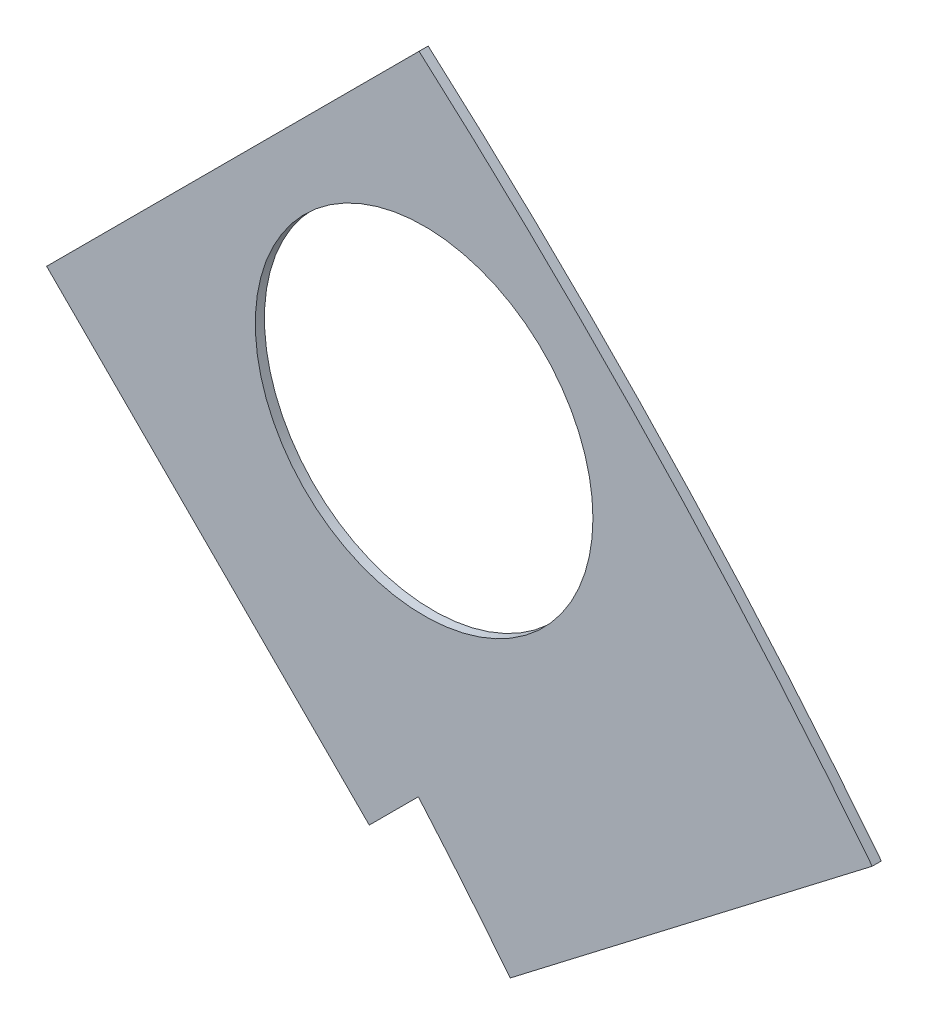
ISO-10303-21;
HEADER;
FILE_DESCRIPTION(('STEP AP214'),'2;1');
FILE_NAME('part.step','',(''),(''),'','','');
FILE_SCHEMA(('AUTOMOTIVE_DESIGN { 1 0 10303 214 1 1 1 1 }'));
ENDSEC;
DATA;
#1=APPLICATION_CONTEXT('core data for automotive mechanical design processes');
#2=APPLICATION_PROTOCOL_DEFINITION('international standard','automotive_design',2000,#1);
#3=PRODUCT_CONTEXT('',#1,'mechanical');
#4=PRODUCT('Part','Part','',(#3));
#5=PRODUCT_RELATED_PRODUCT_CATEGORY('part','',(#4));
#6=PRODUCT_DEFINITION_FORMATION('','',#4);
#7=PRODUCT_DEFINITION_CONTEXT('part definition',#1,'design');
#8=PRODUCT_DEFINITION('design','',#6,#7);
#9=PRODUCT_DEFINITION_SHAPE('','',#8);
#10=(LENGTH_UNIT() NAMED_UNIT(*) SI_UNIT(.MILLI.,.METRE.));
#11=(NAMED_UNIT(*) PLANE_ANGLE_UNIT() SI_UNIT($,.RADIAN.));
#12=(NAMED_UNIT(*) SI_UNIT($,.STERADIAN.) SOLID_ANGLE_UNIT());
#13=UNCERTAINTY_MEASURE_WITH_UNIT(LENGTH_MEASURE(1.E-05),#10,'distance_accuracy_value','');
#14=(GEOMETRIC_REPRESENTATION_CONTEXT(3) GLOBAL_UNCERTAINTY_ASSIGNED_CONTEXT((#13)) GLOBAL_UNIT_ASSIGNED_CONTEXT((#10,
#11,#12)) REPRESENTATION_CONTEXT('',''));
#15=CARTESIAN_POINT('',(0.,0.,0.));
#16=DIRECTION('',(0.,0.,1.));
#17=DIRECTION('',(1.,0.,0.));
#18=AXIS2_PLACEMENT_3D('',#15,#16,#17);
#19=CARTESIAN_POINT('',(0.,0.,0.254));
#20=DIRECTION('',(0.,0.,-1.));
#21=DIRECTION('',(-1.,0.,0.));
#22=AXIS2_PLACEMENT_3D('',#19,#20,#21);
#23=PLANE('',#22);
#24=CARTESIAN_POINT('',(67.3519209080185,67.3519209080188,0.254));
#25=DIRECTION('',(0.,0.,1.));
#26=DIRECTION('',(1.,0.,0.));
#27=AXIS2_PLACEMENT_3D('',#24,#25,#26);
#28=CIRCLE('',#27,4.69899999999999);
#29=CARTESIAN_POINT('',(72.0509209080185,67.3519209080188,0.254));
#30=VERTEX_POINT('',#29);
#31=EDGE_CURVE('E111',#30,#30,#28,.T.);
#32=ORIENTED_EDGE('',*,*,#31,.F.);
#33=EDGE_LOOP('',(#32));
#34=FACE_BOUND('',#33,.T.);
#35=CARTESIAN_POINT('',(0.,0.,0.254));
#36=DIRECTION('',(0.,0.,1.));
#37=DIRECTION('',(-1.,0.,0.));
#38=AXIS2_PLACEMENT_3D('',#35,#36,#37);
#39=CIRCLE('',#38,88.9);
#40=CARTESIAN_POINT('',(69.7487877216676,55.1209271634445,0.254));
#41=VERTEX_POINT('',#40);
#42=CARTESIAN_POINT('',(67.191354125102,58.2110980040331,0.254));
#43=VERTEX_POINT('',#42);
#44=EDGE_CURVE('E50',#41,#43,#39,.T.);
#45=ORIENTED_EDGE('',*,*,#44,.F.);
#46=DIRECTION('',(-0.79335334029125,-0.608761429008702,0.));
#47=VECTOR('',#46,1.);
#48=CARTESIAN_POINT('',(79.3277929876634,62.4711564220355,0.254));
#49=LINE('',#48,#47);
#50=CARTESIAN_POINT('',(79.8252748706045,62.8528876968468,0.254));
#51=VERTEX_POINT('',#50);
#52=EDGE_CURVE('E90',#51,#41,#49,.T.);
#53=ORIENTED_EDGE('',*,*,#52,.F.);
#54=CARTESIAN_POINT('',(0.,0.,0.254));
#55=DIRECTION('',(0.,0.,1.));
#56=DIRECTION('',(-1.,0.,0.));
#57=AXIS2_PLACEMENT_3D('',#54,#55,#56);
#58=CIRCLE('',#57,101.6);
#59=CARTESIAN_POINT('',(67.2114671100052,76.1917232310746,0.254));
#60=VERTEX_POINT('',#59);
#61=EDGE_CURVE('E59',#51,#60,#58,.T.);
#62=ORIENTED_EDGE('',*,*,#61,.T.);
#63=DIRECTION('',(-0.707106781186546,-0.707106781186549,0.));
#64=VECTOR('',#63,1.);
#65=CARTESIAN_POINT('',(67.2114671100052,76.1917232310746,0.254));
#66=LINE('',#65,#64);
#67=CARTESIAN_POINT('',(56.8450212463676,65.825277367437,0.254));
#68=VERTEX_POINT('',#67);
#69=EDGE_CURVE('E119',#60,#68,#66,.T.);
#70=ORIENTED_EDGE('',*,*,#69,.T.);
#71=DIRECTION('',(-0.707106781186548,0.707106781186548,0.));
#72=VECTOR('',#71,1.);
#73=CARTESIAN_POINT('',(56.8450212463676,65.825277367437,0.254));
#74=LINE('',#73,#72);
#75=CARTESIAN_POINT('',(65.8252773674368,56.8450212463678,0.254));
#76=VERTEX_POINT('',#75);
#77=EDGE_CURVE('E141',#76,#68,#74,.T.);
#78=ORIENTED_EDGE('',*,*,#77,.F.);
#79=DIRECTION('',(-0.707106781186546,-0.707106781186549,0.));
#80=VECTOR('',#79,1.);
#81=CARTESIAN_POINT('',(67.191354125102,58.2110980040331,0.254));
#82=LINE('',#81,#80);
#83=EDGE_CURVE('E103',#43,#76,#82,.T.);
#84=ORIENTED_EDGE('',*,*,#83,.F.);
#85=EDGE_LOOP('',(#45,#53,#62,#70,#78,#84));
#86=FACE_BOUND('',#85,.T.);
#87=ADVANCED_FACE('F35',(#34,#86),#23,.F.);
#88=CARTESIAN_POINT('',(0.,0.,0.));
#89=DIRECTION('',(0.,0.,-1.));
#90=DIRECTION('',(-1.,0.,0.));
#91=AXIS2_PLACEMENT_3D('',#88,#89,#90);
#92=PLANE('',#91);
#93=CARTESIAN_POINT('',(67.3519209080185,67.3519209080188,0.));
#94=DIRECTION('',(0.,0.,1.));
#95=DIRECTION('',(1.,0.,0.));
#96=AXIS2_PLACEMENT_3D('',#93,#94,#95);
#97=CIRCLE('',#96,4.69899999999999);
#98=CARTESIAN_POINT('',(72.0509209080185,67.3519209080188,0.));
#99=VERTEX_POINT('',#98);
#100=EDGE_CURVE('E114',#99,#99,#97,.T.);
#101=ORIENTED_EDGE('',*,*,#100,.T.);
#102=EDGE_LOOP('',(#101));
#103=FACE_BOUND('',#102,.T.);
#104=DIRECTION('',(0.79335334029125,0.608761429008702,0.));
#105=VECTOR('',#104,1.);
#106=CARTESIAN_POINT('',(-0.773127014842661,1.00755874217198,0.));
#107=LINE('',#106,#105);
#108=CARTESIAN_POINT('',(69.7487877216676,55.1209271634445,0.));
#109=VERTEX_POINT('',#108);
#110=CARTESIAN_POINT('',(79.8252748706045,62.8528876968468,0.));
#111=VERTEX_POINT('',#110);
#112=EDGE_CURVE('E12',#109,#111,#107,.T.);
#113=ORIENTED_EDGE('',*,*,#112,.F.);
#114=CARTESIAN_POINT('',(0.,0.,0.));
#115=DIRECTION('',(0.,0.,1.));
#116=DIRECTION('',(-1.,0.,0.));
#117=AXIS2_PLACEMENT_3D('',#114,#115,#116);
#118=CIRCLE('',#117,88.9);
#119=CARTESIAN_POINT('',(67.191354125102,58.2110980040331,0.));
#120=VERTEX_POINT('',#119);
#121=EDGE_CURVE('E99',#109,#120,#118,.T.);
#122=ORIENTED_EDGE('',*,*,#121,.T.);
#123=DIRECTION('',(-0.707106781186546,-0.707106781186549,0.));
#124=VECTOR('',#123,1.);
#125=CARTESIAN_POINT('',(67.191354125102,58.2110980040331,0.));
#126=LINE('',#125,#124);
#127=CARTESIAN_POINT('',(65.8252773674368,56.8450212463678,0.));
#128=VERTEX_POINT('',#127);
#129=EDGE_CURVE('E104',#120,#128,#126,.T.);
#130=ORIENTED_EDGE('',*,*,#129,.T.);
#131=DIRECTION('',(-0.707106781186548,0.707106781186548,0.));
#132=VECTOR('',#131,1.);
#133=CARTESIAN_POINT('',(56.8450212463676,65.825277367437,0.));
#134=LINE('',#133,#132);
#135=CARTESIAN_POINT('',(56.8450212463676,65.825277367437,0.));
#136=VERTEX_POINT('',#135);
#137=EDGE_CURVE('E135',#128,#136,#134,.T.);
#138=ORIENTED_EDGE('',*,*,#137,.T.);
#139=DIRECTION('',(-0.707106781186546,-0.707106781186549,0.));
#140=VECTOR('',#139,1.);
#141=CARTESIAN_POINT('',(67.2114671100052,76.1917232310746,0.));
#142=LINE('',#141,#140);
#143=CARTESIAN_POINT('',(67.2114671100052,76.1917232310746,0.));
#144=VERTEX_POINT('',#143);
#145=EDGE_CURVE('E120',#144,#136,#142,.T.);
#146=ORIENTED_EDGE('',*,*,#145,.F.);
#147=CARTESIAN_POINT('',(0.,0.,0.));
#148=DIRECTION('',(0.,0.,1.));
#149=DIRECTION('',(-1.,0.,0.));
#150=AXIS2_PLACEMENT_3D('',#147,#148,#149);
#151=CIRCLE('',#150,101.6);
#152=EDGE_CURVE('E117',#111,#144,#151,.T.);
#153=ORIENTED_EDGE('',*,*,#152,.F.);
#154=EDGE_LOOP('',(#113,#122,#130,#138,#146,#153));
#155=FACE_BOUND('',#154,.T.);
#156=ADVANCED_FACE('F134',(#103,#155),#92,.T.);
#157=CARTESIAN_POINT('',(0.,0.,0.254));
#158=DIRECTION('',(0.,0.,-1.));
#159=DIRECTION('',(-1.,0.,0.));
#160=AXIS2_PLACEMENT_3D('',#157,#158,#159);
#161=CYLINDRICAL_SURFACE('',#160,88.9);
#162=ORIENTED_EDGE('',*,*,#121,.F.);
#163=DIRECTION('',(0.,0.,-1.));
#164=VECTOR('',#163,1.);
#165=CARTESIAN_POINT('',(69.7487877216676,55.1209271634445,0.254));
#166=LINE('',#165,#164);
#167=EDGE_CURVE('E92',#109,#41,#166,.F.);
#168=ORIENTED_EDGE('',*,*,#167,.T.);
#169=ORIENTED_EDGE('',*,*,#44,.T.);
#170=DIRECTION('',(0.,0.,-1.));
#171=VECTOR('',#170,1.);
#172=CARTESIAN_POINT('',(67.191354125102,58.2110980040331,0.254));
#173=LINE('',#172,#171);
#174=EDGE_CURVE('E106',#43,#120,#173,.T.);
#175=ORIENTED_EDGE('',*,*,#174,.T.);
#176=EDGE_LOOP('',(#162,#168,#169,#175));
#177=FACE_BOUND('',#176,.T.);
#178=ADVANCED_FACE('F98',(#177),#161,.F.);
#179=CARTESIAN_POINT('',(67.191354125102,58.2110980040331,0.254));
#180=DIRECTION('',(0.707106781186549,-0.707106781186546,0.));
#181=DIRECTION('',(0.707106781186546,0.707106781186549,0.));
#182=AXIS2_PLACEMENT_3D('',#179,#180,#181);
#183=PLANE('',#182);
#184=ORIENTED_EDGE('',*,*,#83,.T.);
#185=DIRECTION('',(0.,0.,-1.));
#186=VECTOR('',#185,1.);
#187=CARTESIAN_POINT('',(65.8252773674368,56.8450212463678,0.254));
#188=LINE('',#187,#186);
#189=EDGE_CURVE('E96',#76,#128,#188,.T.);
#190=ORIENTED_EDGE('',*,*,#189,.T.);
#191=ORIENTED_EDGE('',*,*,#129,.F.);
#192=ORIENTED_EDGE('',*,*,#174,.F.);
#193=EDGE_LOOP('',(#184,#190,#191,#192));
#194=FACE_BOUND('',#193,.T.);
#195=ADVANCED_FACE('F170',(#194),#183,.T.);
#196=CARTESIAN_POINT('',(0.,0.,0.254));
#197=DIRECTION('',(0.,0.,-1.));
#198=DIRECTION('',(-1.,0.,0.));
#199=AXIS2_PLACEMENT_3D('',#196,#197,#198);
#200=CYLINDRICAL_SURFACE('',#199,101.6);
#201=ORIENTED_EDGE('',*,*,#61,.F.);
#202=DIRECTION('',(0.,0.,-1.));
#203=VECTOR('',#202,1.);
#204=CARTESIAN_POINT('',(79.8252748706045,62.8528876968468,0.254));
#205=LINE('',#204,#203);
#206=EDGE_CURVE('E95',#51,#111,#205,.T.);
#207=ORIENTED_EDGE('',*,*,#206,.T.);
#208=ORIENTED_EDGE('',*,*,#152,.T.);
#209=DIRECTION('',(0.,0.,-1.));
#210=VECTOR('',#209,1.);
#211=CARTESIAN_POINT('',(67.2114671100052,76.1917232310746,0.254));
#212=LINE('',#211,#210);
#213=EDGE_CURVE('E43',#60,#144,#212,.T.);
#214=ORIENTED_EDGE('',*,*,#213,.F.);
#215=EDGE_LOOP('',(#201,#207,#208,#214));
#216=FACE_BOUND('',#215,.T.);
#217=ADVANCED_FACE('F37',(#216),#200,.T.);
#218=CARTESIAN_POINT('',(67.2114671100052,76.1917232310746,0.254));
#219=DIRECTION('',(0.707106781186549,-0.707106781186546,0.));
#220=DIRECTION('',(0.707106781186546,0.707106781186549,0.));
#221=AXIS2_PLACEMENT_3D('',#218,#219,#220);
#222=PLANE('',#221);
#223=ORIENTED_EDGE('',*,*,#145,.T.);
#224=DIRECTION('',(0.,0.,1.));
#225=VECTOR('',#224,1.);
#226=CARTESIAN_POINT('',(56.8450212463676,65.825277367437,0.));
#227=LINE('',#226,#225);
#228=EDGE_CURVE('E140',#136,#68,#227,.T.);
#229=ORIENTED_EDGE('',*,*,#228,.T.);
#230=ORIENTED_EDGE('',*,*,#69,.F.);
#231=ORIENTED_EDGE('',*,*,#213,.T.);
#232=EDGE_LOOP('',(#223,#229,#230,#231));
#233=FACE_BOUND('',#232,.T.);
#234=ADVANCED_FACE('F127',(#233),#222,.F.);
#235=CARTESIAN_POINT('',(67.3519209080185,67.3519209080188,0.));
#236=DIRECTION('',(0.,0.,1.));
#237=DIRECTION('',(1.,0.,0.));
#238=AXIS2_PLACEMENT_3D('',#235,#236,#237);
#239=CYLINDRICAL_SURFACE('',#238,4.69899999999999);
#240=ORIENTED_EDGE('',*,*,#100,.F.);
#241=EDGE_LOOP('',(#240));
#242=FACE_BOUND('',#241,.T.);
#243=ORIENTED_EDGE('',*,*,#31,.T.);
#244=EDGE_LOOP('',(#243));
#245=FACE_BOUND('',#244,.T.);
#246=ADVANCED_FACE('F152',(#242,#245),#239,.F.);
#247=CARTESIAN_POINT('',(56.8450212463676,65.825277367437,0.));
#248=DIRECTION('',(0.707106781186548,0.707106781186548,0.));
#249=DIRECTION('',(-0.707106781186548,0.707106781186548,0.));
#250=AXIS2_PLACEMENT_3D('',#247,#248,#249);
#251=PLANE('',#250);
#252=ORIENTED_EDGE('',*,*,#77,.T.);
#253=ORIENTED_EDGE('',*,*,#228,.F.);
#254=ORIENTED_EDGE('',*,*,#137,.F.);
#255=ORIENTED_EDGE('',*,*,#189,.F.);
#256=EDGE_LOOP('',(#252,#253,#254,#255));
#257=FACE_BOUND('',#256,.T.);
#258=ADVANCED_FACE('F167',(#257),#251,.F.);
#259=CARTESIAN_POINT('',(79.3277929876634,62.4711564220355,0.));
#260=DIRECTION('',(-0.608761429008702,0.79335334029125,0.));
#261=DIRECTION('',(-0.79335334029125,-0.608761429008702,0.));
#262=AXIS2_PLACEMENT_3D('',#259,#260,#261);
#263=PLANE('',#262);
#264=ORIENTED_EDGE('',*,*,#52,.T.);
#265=ORIENTED_EDGE('',*,*,#167,.F.);
#266=ORIENTED_EDGE('',*,*,#112,.T.);
#267=ORIENTED_EDGE('',*,*,#206,.F.);
#268=EDGE_LOOP('',(#264,#265,#266,#267));
#269=FACE_BOUND('',#268,.T.);
#270=ADVANCED_FACE('F91',(#269),#263,.F.);
#271=CLOSED_SHELL('',(#87,#156,#178,#195,#217,#234,#246,#258,#270));
#272=MANIFOLD_SOLID_BREP('B2',#271);
#273=ADVANCED_BREP_SHAPE_REPRESENTATION('',(#18,#272),#14);
#274=SHAPE_DEFINITION_REPRESENTATION(#9,#273);
ENDSEC;
END-ISO-10303-21;
